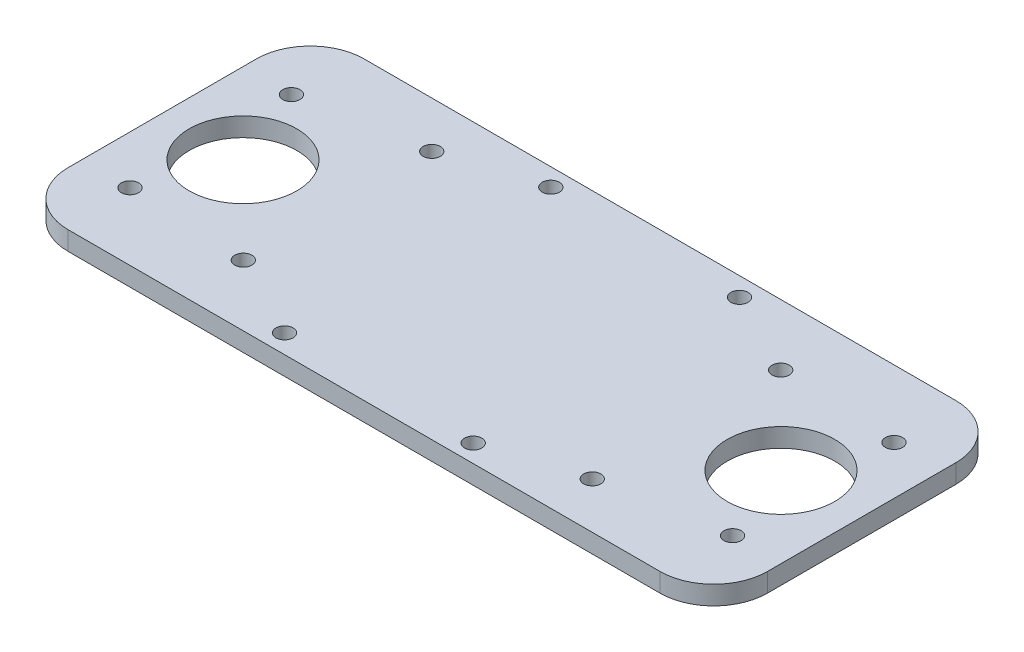
ISO-10303-21;
HEADER;
FILE_DESCRIPTION(('STEP AP214'),'2;1');
FILE_NAME('part.step','',(''),(''),'','','');
FILE_SCHEMA(('AUTOMOTIVE_DESIGN { 1 0 10303 214 1 1 1 1 }'));
ENDSEC;
DATA;
#1=APPLICATION_CONTEXT('core data for automotive mechanical design processes');
#2=APPLICATION_PROTOCOL_DEFINITION('international standard','automotive_design',2000,#1);
#3=PRODUCT_CONTEXT('',#1,'mechanical');
#4=PRODUCT('Part','Part','',(#3));
#5=PRODUCT_RELATED_PRODUCT_CATEGORY('part','',(#4));
#6=PRODUCT_DEFINITION_FORMATION('','',#4);
#7=PRODUCT_DEFINITION_CONTEXT('part definition',#1,'design');
#8=PRODUCT_DEFINITION('design','',#6,#7);
#9=PRODUCT_DEFINITION_SHAPE('','',#8);
#10=(LENGTH_UNIT() NAMED_UNIT(*) SI_UNIT(.MILLI.,.METRE.));
#11=(NAMED_UNIT(*) PLANE_ANGLE_UNIT() SI_UNIT($,.RADIAN.));
#12=(NAMED_UNIT(*) SI_UNIT($,.STERADIAN.) SOLID_ANGLE_UNIT());
#13=UNCERTAINTY_MEASURE_WITH_UNIT(LENGTH_MEASURE(1.E-05),#10,'distance_accuracy_value','');
#14=(GEOMETRIC_REPRESENTATION_CONTEXT(3) GLOBAL_UNCERTAINTY_ASSIGNED_CONTEXT((#13)) GLOBAL_UNIT_ASSIGNED_CONTEXT((#10,
#11,#12)) REPRESENTATION_CONTEXT('',''));
#15=CARTESIAN_POINT('',(0.,0.,0.));
#16=DIRECTION('',(0.,0.,1.));
#17=DIRECTION('',(1.,0.,0.));
#18=AXIS2_PLACEMENT_3D('',#15,#16,#17);
#19=CARTESIAN_POINT('',(0.,3.5,0.));
#20=DIRECTION('',(0.,1.,0.));
#21=DIRECTION('',(0.,0.,1.));
#22=AXIS2_PLACEMENT_3D('',#19,#20,#21);
#23=PLANE('',#22);
#24=CARTESIAN_POINT('',(31.1831474859931,3.5,8.59999999999931));
#25=DIRECTION('',(0.,1.,0.));
#26=DIRECTION('',(0.,0.,1.));
#27=AXIS2_PLACEMENT_3D('',#24,#25,#26);
#28=CIRCLE('',#27,1.6);
#29=CARTESIAN_POINT('',(31.1831474859931,3.5,10.1999999999993));
#30=VERTEX_POINT('',#29);
#31=EDGE_CURVE('E287',#30,#30,#28,.T.);
#32=ORIENTED_EDGE('',*,*,#31,.F.);
#33=EDGE_LOOP('',(#32));
#34=FACE_BOUND('',#33,.T.);
#35=CARTESIAN_POINT('',(15.,3.5,27.5));
#36=DIRECTION('',(0.,1.,0.));
#37=DIRECTION('',(0.,0.,1.));
#38=AXIS2_PLACEMENT_3D('',#35,#36,#37);
#39=CIRCLE('',#38,10.);
#40=CARTESIAN_POINT('',(15.,3.5,37.5));
#41=VERTEX_POINT('',#40);
#42=EDGE_CURVE('E271',#41,#41,#39,.T.);
#43=ORIENTED_EDGE('',*,*,#42,.F.);
#44=EDGE_LOOP('',(#43));
#45=FACE_BOUND('',#44,.T.);
#46=CARTESIAN_POINT('',(81.9831474859928,3.5,51.6999999999997));
#47=DIRECTION('',(0.,1.,0.));
#48=DIRECTION('',(0.,0.,1.));
#49=AXIS2_PLACEMENT_3D('',#46,#47,#48);
#50=CIRCLE('',#49,1.6);
#51=CARTESIAN_POINT('',(81.9831474859928,3.5,53.2999999999997));
#52=VERTEX_POINT('',#51);
#53=EDGE_CURVE('E255',#52,#52,#50,.T.);
#54=ORIENTED_EDGE('',*,*,#53,.F.);
#55=EDGE_LOOP('',(#54));
#56=FACE_BOUND('',#55,.T.);
#57=CARTESIAN_POINT('',(98.8168525140077,3.5,11.3789357077692));
#58=DIRECTION('',(0.,1.,0.));
#59=DIRECTION('',(0.,0.,1.));
#60=AXIS2_PLACEMENT_3D('',#57,#58,#59);
#61=CIRCLE('',#60,1.6);
#62=CARTESIAN_POINT('',(98.8168525140077,3.5,12.9789357077692));
#63=VERTEX_POINT('',#62);
#64=EDGE_CURVE('E239',#63,#63,#61,.T.);
#65=ORIENTED_EDGE('',*,*,#64,.F.);
#66=EDGE_LOOP('',(#65));
#67=FACE_BOUND('',#66,.T.);
#68=CARTESIAN_POINT('',(121.,3.5,42.5));
#69=DIRECTION('',(0.,1.,0.));
#70=DIRECTION('',(0.,0.,-1.));
#71=AXIS2_PLACEMENT_3D('',#68,#69,#70);
#72=CIRCLE('',#71,1.59999999999999);
#73=CARTESIAN_POINT('',(121.,3.5,40.9));
#74=VERTEX_POINT('',#73);
#75=EDGE_CURVE('E223',#74,#74,#72,.T.);
#76=ORIENTED_EDGE('',*,*,#75,.F.);
#77=EDGE_LOOP('',(#76));
#78=FACE_BOUND('',#77,.T.);
#79=CARTESIAN_POINT('',(48.0168525140077,3.5,3.3));
#80=DIRECTION('',(0.,1.,0.));
#81=DIRECTION('',(0.,0.,1.));
#82=AXIS2_PLACEMENT_3D('',#79,#80,#81);
#83=CIRCLE('',#82,1.6);
#84=CARTESIAN_POINT('',(48.0168525140077,3.5,4.9));
#85=VERTEX_POINT('',#84);
#86=EDGE_CURVE('E207',#85,#85,#83,.T.);
#87=ORIENTED_EDGE('',*,*,#86,.F.);
#88=EDGE_LOOP('',(#87));
#89=FACE_BOUND('',#88,.T.);
#90=CARTESIAN_POINT('',(9.,3.5,12.5));
#91=DIRECTION('',(0.,1.,0.));
#92=DIRECTION('',(0.,0.,1.));
#93=AXIS2_PLACEMENT_3D('',#90,#91,#92);
#94=CIRCLE('',#93,1.6);
#95=CARTESIAN_POINT('',(9.,3.5,14.1));
#96=VERTEX_POINT('',#95);
#97=EDGE_CURVE('E137',#96,#96,#94,.T.);
#98=ORIENTED_EDGE('',*,*,#97,.F.);
#99=EDGE_LOOP('',(#98));
#100=FACE_BOUND('',#99,.T.);
#101=DIRECTION('',(-1.,0.,0.));
#102=VECTOR('',#101,1.);
#103=CARTESIAN_POINT('',(0.,3.5,0.));
#104=LINE('',#103,#102);
#105=CARTESIAN_POINT('',(120.,3.5,0.));
#106=VERTEX_POINT('',#105);
#107=CARTESIAN_POINT('',(10.,3.5,0.));
#108=VERTEX_POINT('',#107);
#109=EDGE_CURVE('E148',#106,#108,#104,.T.);
#110=ORIENTED_EDGE('',*,*,#109,.T.);
#111=CARTESIAN_POINT('',(10.,3.5,10.));
#112=DIRECTION('',(0.,1.,0.));
#113=DIRECTION('',(0.,0.,1.));
#114=AXIS2_PLACEMENT_3D('',#111,#112,#113);
#115=CIRCLE('',#114,10.);
#116=CARTESIAN_POINT('',(0.,3.5,10.));
#117=VERTEX_POINT('',#116);
#118=EDGE_CURVE('E178',#108,#117,#115,.T.);
#119=ORIENTED_EDGE('',*,*,#118,.T.);
#120=DIRECTION('',(0.,0.,1.));
#121=VECTOR('',#120,1.);
#122=CARTESIAN_POINT('',(0.,3.5,0.));
#123=LINE('',#122,#121);
#124=CARTESIAN_POINT('',(0.,3.5,45.));
#125=VERTEX_POINT('',#124);
#126=EDGE_CURVE('E127',#117,#125,#123,.T.);
#127=ORIENTED_EDGE('',*,*,#126,.T.);
#128=CARTESIAN_POINT('',(10.,3.5,45.));
#129=DIRECTION('',(0.,1.,0.));
#130=DIRECTION('',(0.,0.,1.));
#131=AXIS2_PLACEMENT_3D('',#128,#129,#130);
#132=CIRCLE('',#131,10.);
#133=CARTESIAN_POINT('',(10.,3.5,55.));
#134=VERTEX_POINT('',#133);
#135=EDGE_CURVE('E175',#125,#134,#132,.T.);
#136=ORIENTED_EDGE('',*,*,#135,.T.);
#137=DIRECTION('',(1.,0.,0.));
#138=VECTOR('',#137,1.);
#139=CARTESIAN_POINT('',(0.,3.5,55.));
#140=LINE('',#139,#138);
#141=CARTESIAN_POINT('',(120.,3.5,55.));
#142=VERTEX_POINT('',#141);
#143=EDGE_CURVE('E193',#134,#142,#140,.T.);
#144=ORIENTED_EDGE('',*,*,#143,.T.);
#145=CARTESIAN_POINT('',(120.,3.5,45.));
#146=DIRECTION('',(0.,1.,0.));
#147=DIRECTION('',(0.,0.,1.));
#148=AXIS2_PLACEMENT_3D('',#145,#146,#147);
#149=CIRCLE('',#148,10.);
#150=CARTESIAN_POINT('',(130.,3.5,45.));
#151=VERTEX_POINT('',#150);
#152=EDGE_CURVE('E61',#142,#151,#149,.T.);
#153=ORIENTED_EDGE('',*,*,#152,.T.);
#154=DIRECTION('',(0.,0.,-1.));
#155=VECTOR('',#154,1.);
#156=CARTESIAN_POINT('',(130.,3.5,0.));
#157=LINE('',#156,#155);
#158=CARTESIAN_POINT('',(130.,3.5,10.));
#159=VERTEX_POINT('',#158);
#160=EDGE_CURVE('E191',#151,#159,#157,.T.);
#161=ORIENTED_EDGE('',*,*,#160,.T.);
#162=CARTESIAN_POINT('',(120.,3.5,10.));
#163=DIRECTION('',(0.,1.,0.));
#164=DIRECTION('',(0.,0.,1.));
#165=AXIS2_PLACEMENT_3D('',#162,#163,#164);
#166=CIRCLE('',#165,10.);
#167=EDGE_CURVE('E170',#159,#106,#166,.T.);
#168=ORIENTED_EDGE('',*,*,#167,.T.);
#169=EDGE_LOOP('',(#110,#119,#127,#136,#144,#153,#161,#168));
#170=FACE_BOUND('',#169,.T.);
#171=CARTESIAN_POINT('',(9.00000000000007,3.5,42.5));
#172=DIRECTION('',(0.,1.,0.));
#173=DIRECTION('',(0.,0.,1.));
#174=AXIS2_PLACEMENT_3D('',#171,#172,#173);
#175=CIRCLE('',#174,1.59999999999993);
#176=CARTESIAN_POINT('',(9.00000000000007,3.5,44.0999999999999));
#177=VERTEX_POINT('',#176);
#178=EDGE_CURVE('E201',#177,#177,#175,.T.);
#179=ORIENTED_EDGE('',*,*,#178,.F.);
#180=EDGE_LOOP('',(#179));
#181=FACE_BOUND('',#180,.T.);
#182=CARTESIAN_POINT('',(46.7168525140077,3.5,51.5));
#183=DIRECTION('',(0.,1.,0.));
#184=DIRECTION('',(0.,0.,1.));
#185=AXIS2_PLACEMENT_3D('',#182,#183,#184);
#186=CIRCLE('',#185,1.6);
#187=CARTESIAN_POINT('',(46.7168525140077,3.5,53.1));
#188=VERTEX_POINT('',#187);
#189=EDGE_CURVE('E215',#188,#188,#186,.T.);
#190=ORIENTED_EDGE('',*,*,#189,.F.);
#191=EDGE_LOOP('',(#190));
#192=FACE_BOUND('',#191,.T.);
#193=CARTESIAN_POINT('',(98.8168525140077,3.5,46.4));
#194=DIRECTION('',(0.,1.,0.));
#195=DIRECTION('',(0.,0.,1.));
#196=AXIS2_PLACEMENT_3D('',#193,#194,#195);
#197=CIRCLE('',#196,1.60000000000001);
#198=CARTESIAN_POINT('',(98.8168525140077,3.5,48.));
#199=VERTEX_POINT('',#198);
#200=EDGE_CURVE('E231',#199,#199,#197,.T.);
#201=ORIENTED_EDGE('',*,*,#200,.F.);
#202=EDGE_LOOP('',(#201));
#203=FACE_BOUND('',#202,.T.);
#204=CARTESIAN_POINT('',(121.,3.5,12.5));
#205=DIRECTION('',(0.,1.,0.));
#206=DIRECTION('',(0.,0.,-1.));
#207=AXIS2_PLACEMENT_3D('',#204,#205,#206);
#208=CIRCLE('',#207,1.59999999999999);
#209=CARTESIAN_POINT('',(121.,3.5,10.9));
#210=VERTEX_POINT('',#209);
#211=EDGE_CURVE('E247',#210,#210,#208,.T.);
#212=ORIENTED_EDGE('',*,*,#211,.F.);
#213=EDGE_LOOP('',(#212));
#214=FACE_BOUND('',#213,.T.);
#215=CARTESIAN_POINT('',(83.2831474859932,3.5,3.49999999999966));
#216=DIRECTION('',(0.,1.,0.));
#217=DIRECTION('',(0.,0.,1.));
#218=AXIS2_PLACEMENT_3D('',#215,#216,#217);
#219=CIRCLE('',#218,1.6);
#220=CARTESIAN_POINT('',(83.2831474859932,3.5,5.09999999999966));
#221=VERTEX_POINT('',#220);
#222=EDGE_CURVE('E263',#221,#221,#219,.T.);
#223=ORIENTED_EDGE('',*,*,#222,.F.);
#224=EDGE_LOOP('',(#223));
#225=FACE_BOUND('',#224,.T.);
#226=CARTESIAN_POINT('',(115.,3.5,27.5));
#227=DIRECTION('',(0.,1.,0.));
#228=DIRECTION('',(0.,0.,1.));
#229=AXIS2_PLACEMENT_3D('',#226,#227,#228);
#230=CIRCLE('',#229,9.99999999999999);
#231=CARTESIAN_POINT('',(115.,3.5,37.5));
#232=VERTEX_POINT('',#231);
#233=EDGE_CURVE('E279',#232,#232,#230,.T.);
#234=ORIENTED_EDGE('',*,*,#233,.F.);
#235=EDGE_LOOP('',(#234));
#236=FACE_BOUND('',#235,.T.);
#237=CARTESIAN_POINT('',(31.1831474859929,3.5,43.6210642922301));
#238=DIRECTION('',(0.,1.,0.));
#239=DIRECTION('',(0.,0.,1.));
#240=AXIS2_PLACEMENT_3D('',#237,#238,#239);
#241=CIRCLE('',#240,1.60000000000002);
#242=CARTESIAN_POINT('',(31.1831474859929,3.5,45.2210642922301));
#243=VERTEX_POINT('',#242);
#244=EDGE_CURVE('E295',#243,#243,#241,.T.);
#245=ORIENTED_EDGE('',*,*,#244,.F.);
#246=EDGE_LOOP('',(#245));
#247=FACE_BOUND('',#246,.T.);
#248=ADVANCED_FACE('F39',(#34,#45,#56,#67,#78,#89,#100,#170,#181,#192,#203,#214,#225,#236,#247),
#23,.T.);
#249=CARTESIAN_POINT('',(0.,0.,0.));
#250=DIRECTION('',(0.,1.,0.));
#251=DIRECTION('',(0.,0.,1.));
#252=AXIS2_PLACEMENT_3D('',#249,#250,#251);
#253=PLANE('',#252);
#254=DIRECTION('',(0.,0.,1.));
#255=VECTOR('',#254,1.);
#256=CARTESIAN_POINT('',(0.,0.,0.));
#257=LINE('',#256,#255);
#258=CARTESIAN_POINT('',(0.,0.,10.));
#259=VERTEX_POINT('',#258);
#260=CARTESIAN_POINT('',(0.,0.,45.));
#261=VERTEX_POINT('',#260);
#262=EDGE_CURVE('E124',#259,#261,#257,.T.);
#263=ORIENTED_EDGE('',*,*,#262,.F.);
#264=CARTESIAN_POINT('',(10.,0.,10.));
#265=DIRECTION('',(0.,1.,0.));
#266=DIRECTION('',(0.,0.,1.));
#267=AXIS2_PLACEMENT_3D('',#264,#265,#266);
#268=CIRCLE('',#267,10.);
#269=CARTESIAN_POINT('',(10.,0.,0.));
#270=VERTEX_POINT('',#269);
#271=EDGE_CURVE('E106',#259,#270,#268,.F.);
#272=ORIENTED_EDGE('',*,*,#271,.T.);
#273=DIRECTION('',(-1.,0.,0.));
#274=VECTOR('',#273,1.);
#275=CARTESIAN_POINT('',(0.,0.,0.));
#276=LINE('',#275,#274);
#277=CARTESIAN_POINT('',(120.,0.,0.));
#278=VERTEX_POINT('',#277);
#279=EDGE_CURVE('E153',#278,#270,#276,.T.);
#280=ORIENTED_EDGE('',*,*,#279,.F.);
#281=CARTESIAN_POINT('',(120.,0.,10.));
#282=DIRECTION('',(0.,1.,0.));
#283=DIRECTION('',(0.,0.,1.));
#284=AXIS2_PLACEMENT_3D('',#281,#282,#283);
#285=CIRCLE('',#284,10.);
#286=CARTESIAN_POINT('',(130.,0.,10.));
#287=VERTEX_POINT('',#286);
#288=EDGE_CURVE('E129',#278,#287,#285,.F.);
#289=ORIENTED_EDGE('',*,*,#288,.T.);
#290=DIRECTION('',(0.,0.,-1.));
#291=VECTOR('',#290,1.);
#292=CARTESIAN_POINT('',(130.,0.,0.));
#293=LINE('',#292,#291);
#294=CARTESIAN_POINT('',(130.,0.,45.));
#295=VERTEX_POINT('',#294);
#296=EDGE_CURVE('E142',#295,#287,#293,.T.);
#297=ORIENTED_EDGE('',*,*,#296,.F.);
#298=CARTESIAN_POINT('',(120.,0.,45.));
#299=DIRECTION('',(0.,1.,0.));
#300=DIRECTION('',(0.,0.,1.));
#301=AXIS2_PLACEMENT_3D('',#298,#299,#300);
#302=CIRCLE('',#301,10.);
#303=CARTESIAN_POINT('',(120.,0.,55.));
#304=VERTEX_POINT('',#303);
#305=EDGE_CURVE('E160',#295,#304,#302,.F.);
#306=ORIENTED_EDGE('',*,*,#305,.T.);
#307=DIRECTION('',(1.,0.,0.));
#308=VECTOR('',#307,1.);
#309=CARTESIAN_POINT('',(0.,0.,55.));
#310=LINE('',#309,#308);
#311=CARTESIAN_POINT('',(10.,0.,55.));
#312=VERTEX_POINT('',#311);
#313=EDGE_CURVE('E136',#312,#304,#310,.T.);
#314=ORIENTED_EDGE('',*,*,#313,.F.);
#315=CARTESIAN_POINT('',(10.,0.,45.));
#316=DIRECTION('',(0.,1.,0.));
#317=DIRECTION('',(0.,0.,1.));
#318=AXIS2_PLACEMENT_3D('',#315,#316,#317);
#319=CIRCLE('',#318,10.);
#320=EDGE_CURVE('E118',#312,#261,#319,.F.);
#321=ORIENTED_EDGE('',*,*,#320,.T.);
#322=EDGE_LOOP('',(#263,#272,#280,#289,#297,#306,#314,#321));
#323=FACE_BOUND('',#322,.T.);
#324=CARTESIAN_POINT('',(9.,0.,12.5));
#325=DIRECTION('',(0.,1.,0.));
#326=DIRECTION('',(0.,0.,1.));
#327=AXIS2_PLACEMENT_3D('',#324,#325,#326);
#328=CIRCLE('',#327,1.6);
#329=CARTESIAN_POINT('',(9.,0.,14.1));
#330=VERTEX_POINT('',#329);
#331=EDGE_CURVE('E145',#330,#330,#328,.T.);
#332=ORIENTED_EDGE('',*,*,#331,.T.);
#333=EDGE_LOOP('',(#332));
#334=FACE_BOUND('',#333,.T.);
#335=CARTESIAN_POINT('',(9.00000000000007,0.,42.5));
#336=DIRECTION('',(0.,1.,0.));
#337=DIRECTION('',(0.,0.,1.));
#338=AXIS2_PLACEMENT_3D('',#335,#336,#337);
#339=CIRCLE('',#338,1.59999999999993);
#340=CARTESIAN_POINT('',(9.00000000000007,0.,44.0999999999999));
#341=VERTEX_POINT('',#340);
#342=EDGE_CURVE('E203',#341,#341,#339,.T.);
#343=ORIENTED_EDGE('',*,*,#342,.T.);
#344=EDGE_LOOP('',(#343));
#345=FACE_BOUND('',#344,.T.);
#346=CARTESIAN_POINT('',(48.0168525140077,0.,3.3));
#347=DIRECTION('',(0.,1.,0.));
#348=DIRECTION('',(0.,0.,1.));
#349=AXIS2_PLACEMENT_3D('',#346,#347,#348);
#350=CIRCLE('',#349,1.6);
#351=CARTESIAN_POINT('',(48.0168525140077,0.,4.9));
#352=VERTEX_POINT('',#351);
#353=EDGE_CURVE('E211',#352,#352,#350,.T.);
#354=ORIENTED_EDGE('',*,*,#353,.T.);
#355=EDGE_LOOP('',(#354));
#356=FACE_BOUND('',#355,.T.);
#357=CARTESIAN_POINT('',(46.7168525140077,0.,51.5));
#358=DIRECTION('',(0.,1.,0.));
#359=DIRECTION('',(0.,0.,1.));
#360=AXIS2_PLACEMENT_3D('',#357,#358,#359);
#361=CIRCLE('',#360,1.6);
#362=CARTESIAN_POINT('',(46.7168525140077,0.,53.1));
#363=VERTEX_POINT('',#362);
#364=EDGE_CURVE('E219',#363,#363,#361,.T.);
#365=ORIENTED_EDGE('',*,*,#364,.T.);
#366=EDGE_LOOP('',(#365));
#367=FACE_BOUND('',#366,.T.);
#368=CARTESIAN_POINT('',(121.,0.,42.5));
#369=DIRECTION('',(0.,1.,0.));
#370=DIRECTION('',(0.,0.,-1.));
#371=AXIS2_PLACEMENT_3D('',#368,#369,#370);
#372=CIRCLE('',#371,1.59999999999999);
#373=CARTESIAN_POINT('',(121.,0.,40.9));
#374=VERTEX_POINT('',#373);
#375=EDGE_CURVE('E227',#374,#374,#372,.T.);
#376=ORIENTED_EDGE('',*,*,#375,.T.);
#377=EDGE_LOOP('',(#376));
#378=FACE_BOUND('',#377,.T.);
#379=CARTESIAN_POINT('',(98.8168525140077,0.,46.4));
#380=DIRECTION('',(0.,1.,0.));
#381=DIRECTION('',(0.,0.,1.));
#382=AXIS2_PLACEMENT_3D('',#379,#380,#381);
#383=CIRCLE('',#382,1.60000000000001);
#384=CARTESIAN_POINT('',(98.8168525140077,0.,48.));
#385=VERTEX_POINT('',#384);
#386=EDGE_CURVE('E235',#385,#385,#383,.T.);
#387=ORIENTED_EDGE('',*,*,#386,.T.);
#388=EDGE_LOOP('',(#387));
#389=FACE_BOUND('',#388,.T.);
#390=CARTESIAN_POINT('',(98.8168525140077,0.,11.3789357077692));
#391=DIRECTION('',(0.,1.,0.));
#392=DIRECTION('',(0.,0.,1.));
#393=AXIS2_PLACEMENT_3D('',#390,#391,#392);
#394=CIRCLE('',#393,1.6);
#395=CARTESIAN_POINT('',(98.8168525140077,0.,12.9789357077692));
#396=VERTEX_POINT('',#395);
#397=EDGE_CURVE('E243',#396,#396,#394,.T.);
#398=ORIENTED_EDGE('',*,*,#397,.T.);
#399=EDGE_LOOP('',(#398));
#400=FACE_BOUND('',#399,.T.);
#401=CARTESIAN_POINT('',(121.,0.,12.5));
#402=DIRECTION('',(0.,1.,0.));
#403=DIRECTION('',(0.,0.,-1.));
#404=AXIS2_PLACEMENT_3D('',#401,#402,#403);
#405=CIRCLE('',#404,1.59999999999999);
#406=CARTESIAN_POINT('',(121.,0.,10.9));
#407=VERTEX_POINT('',#406);
#408=EDGE_CURVE('E251',#407,#407,#405,.T.);
#409=ORIENTED_EDGE('',*,*,#408,.T.);
#410=EDGE_LOOP('',(#409));
#411=FACE_BOUND('',#410,.T.);
#412=CARTESIAN_POINT('',(81.9831474859928,0.,51.6999999999997));
#413=DIRECTION('',(0.,1.,0.));
#414=DIRECTION('',(0.,0.,1.));
#415=AXIS2_PLACEMENT_3D('',#412,#413,#414);
#416=CIRCLE('',#415,1.6);
#417=CARTESIAN_POINT('',(81.9831474859928,0.,53.2999999999997));
#418=VERTEX_POINT('',#417);
#419=EDGE_CURVE('E259',#418,#418,#416,.T.);
#420=ORIENTED_EDGE('',*,*,#419,.T.);
#421=EDGE_LOOP('',(#420));
#422=FACE_BOUND('',#421,.T.);
#423=CARTESIAN_POINT('',(83.2831474859932,0.,3.49999999999966));
#424=DIRECTION('',(0.,1.,0.));
#425=DIRECTION('',(0.,0.,1.));
#426=AXIS2_PLACEMENT_3D('',#423,#424,#425);
#427=CIRCLE('',#426,1.6);
#428=CARTESIAN_POINT('',(83.2831474859932,0.,5.09999999999966));
#429=VERTEX_POINT('',#428);
#430=EDGE_CURVE('E267',#429,#429,#427,.T.);
#431=ORIENTED_EDGE('',*,*,#430,.T.);
#432=EDGE_LOOP('',(#431));
#433=FACE_BOUND('',#432,.T.);
#434=CARTESIAN_POINT('',(15.,0.,27.5));
#435=DIRECTION('',(0.,1.,0.));
#436=DIRECTION('',(0.,0.,1.));
#437=AXIS2_PLACEMENT_3D('',#434,#435,#436);
#438=CIRCLE('',#437,10.);
#439=CARTESIAN_POINT('',(15.,0.,37.5));
#440=VERTEX_POINT('',#439);
#441=EDGE_CURVE('E275',#440,#440,#438,.T.);
#442=ORIENTED_EDGE('',*,*,#441,.T.);
#443=EDGE_LOOP('',(#442));
#444=FACE_BOUND('',#443,.T.);
#445=CARTESIAN_POINT('',(115.,0.,27.5));
#446=DIRECTION('',(0.,1.,0.));
#447=DIRECTION('',(0.,0.,1.));
#448=AXIS2_PLACEMENT_3D('',#445,#446,#447);
#449=CIRCLE('',#448,9.99999999999999);
#450=CARTESIAN_POINT('',(115.,0.,37.5));
#451=VERTEX_POINT('',#450);
#452=EDGE_CURVE('E283',#451,#451,#449,.T.);
#453=ORIENTED_EDGE('',*,*,#452,.T.);
#454=EDGE_LOOP('',(#453));
#455=FACE_BOUND('',#454,.T.);
#456=CARTESIAN_POINT('',(31.1831474859931,0.,8.59999999999931));
#457=DIRECTION('',(0.,1.,0.));
#458=DIRECTION('',(0.,0.,1.));
#459=AXIS2_PLACEMENT_3D('',#456,#457,#458);
#460=CIRCLE('',#459,1.6);
#461=CARTESIAN_POINT('',(31.1831474859931,0.,10.1999999999993));
#462=VERTEX_POINT('',#461);
#463=EDGE_CURVE('E291',#462,#462,#460,.T.);
#464=ORIENTED_EDGE('',*,*,#463,.T.);
#465=EDGE_LOOP('',(#464));
#466=FACE_BOUND('',#465,.T.);
#467=CARTESIAN_POINT('',(31.1831474859929,0.,43.6210642922301));
#468=DIRECTION('',(0.,1.,0.));
#469=DIRECTION('',(0.,0.,1.));
#470=AXIS2_PLACEMENT_3D('',#467,#468,#469);
#471=CIRCLE('',#470,1.60000000000002);
#472=CARTESIAN_POINT('',(31.1831474859929,0.,45.2210642922301));
#473=VERTEX_POINT('',#472);
#474=EDGE_CURVE('E299',#473,#473,#471,.T.);
#475=ORIENTED_EDGE('',*,*,#474,.T.);
#476=EDGE_LOOP('',(#475));
#477=FACE_BOUND('',#476,.T.);
#478=ADVANCED_FACE('F132',(#323,#334,#345,#356,#367,#378,#389,#400,#411,#422,#433,#444,#455,
#466,#477),#253,.F.);
#479=CARTESIAN_POINT('',(0.,3.5,0.));
#480=DIRECTION('',(1.,0.,0.));
#481=DIRECTION('',(0.,0.,-1.));
#482=AXIS2_PLACEMENT_3D('',#479,#480,#481);
#483=PLANE('',#482);
#484=ORIENTED_EDGE('',*,*,#126,.F.);
#485=DIRECTION('',(0.,-1.,0.));
#486=VECTOR('',#485,1.);
#487=CARTESIAN_POINT('',(0.,3.5,10.));
#488=LINE('',#487,#486);
#489=EDGE_CURVE('E110',#117,#259,#488,.T.);
#490=ORIENTED_EDGE('',*,*,#489,.T.);
#491=ORIENTED_EDGE('',*,*,#262,.T.);
#492=DIRECTION('',(0.,-1.,0.));
#493=VECTOR('',#492,1.);
#494=CARTESIAN_POINT('',(0.,3.5,45.));
#495=LINE('',#494,#493);
#496=EDGE_CURVE('E130',#261,#125,#495,.F.);
#497=ORIENTED_EDGE('',*,*,#496,.T.);
#498=EDGE_LOOP('',(#484,#490,#491,#497));
#499=FACE_BOUND('',#498,.T.);
#500=ADVANCED_FACE('F123',(#499),#483,.F.);
#501=CARTESIAN_POINT('',(0.,3.5,55.));
#502=DIRECTION('',(0.,0.,-1.));
#503=DIRECTION('',(-1.,0.,0.));
#504=AXIS2_PLACEMENT_3D('',#501,#502,#503);
#505=PLANE('',#504);
#506=ORIENTED_EDGE('',*,*,#143,.F.);
#507=DIRECTION('',(0.,-1.,0.));
#508=VECTOR('',#507,1.);
#509=CARTESIAN_POINT('',(10.,3.5,55.));
#510=LINE('',#509,#508);
#511=EDGE_CURVE('E184',#134,#312,#510,.T.);
#512=ORIENTED_EDGE('',*,*,#511,.T.);
#513=ORIENTED_EDGE('',*,*,#313,.T.);
#514=DIRECTION('',(0.,-1.,0.));
#515=VECTOR('',#514,1.);
#516=CARTESIAN_POINT('',(120.,3.5,55.));
#517=LINE('',#516,#515);
#518=EDGE_CURVE('E181',#304,#142,#517,.F.);
#519=ORIENTED_EDGE('',*,*,#518,.T.);
#520=EDGE_LOOP('',(#506,#512,#513,#519));
#521=FACE_BOUND('',#520,.T.);
#522=ADVANCED_FACE('F330',(#521),#505,.F.);
#523=CARTESIAN_POINT('',(130.,3.5,0.));
#524=DIRECTION('',(-1.,0.,0.));
#525=DIRECTION('',(0.,0.,1.));
#526=AXIS2_PLACEMENT_3D('',#523,#524,#525);
#527=PLANE('',#526);
#528=ORIENTED_EDGE('',*,*,#160,.F.);
#529=DIRECTION('',(0.,-1.,0.));
#530=VECTOR('',#529,1.);
#531=CARTESIAN_POINT('',(130.,3.5,45.));
#532=LINE('',#531,#530);
#533=EDGE_CURVE('E11',#151,#295,#532,.T.);
#534=ORIENTED_EDGE('',*,*,#533,.T.);
#535=ORIENTED_EDGE('',*,*,#296,.T.);
#536=DIRECTION('',(0.,-1.,0.));
#537=VECTOR('',#536,1.);
#538=CARTESIAN_POINT('',(130.,3.5,10.));
#539=LINE('',#538,#537);
#540=EDGE_CURVE('E48',#287,#159,#539,.F.);
#541=ORIENTED_EDGE('',*,*,#540,.T.);
#542=EDGE_LOOP('',(#528,#534,#535,#541));
#543=FACE_BOUND('',#542,.T.);
#544=ADVANCED_FACE('F326',(#543),#527,.F.);
#545=CARTESIAN_POINT('',(0.,3.5,0.));
#546=DIRECTION('',(0.,0.,1.));
#547=DIRECTION('',(1.,0.,0.));
#548=AXIS2_PLACEMENT_3D('',#545,#546,#547);
#549=PLANE('',#548);
#550=ORIENTED_EDGE('',*,*,#279,.T.);
#551=DIRECTION('',(0.,-1.,0.));
#552=VECTOR('',#551,1.);
#553=CARTESIAN_POINT('',(10.,3.5,0.));
#554=LINE('',#553,#552);
#555=EDGE_CURVE('E111',#270,#108,#554,.F.);
#556=ORIENTED_EDGE('',*,*,#555,.T.);
#557=ORIENTED_EDGE('',*,*,#109,.F.);
#558=DIRECTION('',(0.,-1.,0.));
#559=VECTOR('',#558,1.);
#560=CARTESIAN_POINT('',(120.,3.5,0.));
#561=LINE('',#560,#559);
#562=EDGE_CURVE('E117',#106,#278,#561,.T.);
#563=ORIENTED_EDGE('',*,*,#562,.T.);
#564=EDGE_LOOP('',(#550,#556,#557,#563));
#565=FACE_BOUND('',#564,.T.);
#566=ADVANCED_FACE('F323',(#565),#549,.F.);
#567=CARTESIAN_POINT('',(9.,3.5,12.5));
#568=DIRECTION('',(0.,-1.,0.));
#569=DIRECTION('',(0.,0.,-1.));
#570=AXIS2_PLACEMENT_3D('',#567,#568,#569);
#571=CYLINDRICAL_SURFACE('',#570,1.6);
#572=ORIENTED_EDGE('',*,*,#97,.T.);
#573=EDGE_LOOP('',(#572));
#574=FACE_BOUND('',#573,.T.);
#575=ORIENTED_EDGE('',*,*,#331,.F.);
#576=EDGE_LOOP('',(#575));
#577=FACE_BOUND('',#576,.T.);
#578=ADVANCED_FACE('F320',(#574,#577),#571,.F.);
#579=CARTESIAN_POINT('',(9.00000000000007,3.5,42.5));
#580=DIRECTION('',(0.,-1.,0.));
#581=DIRECTION('',(0.,0.,-1.));
#582=AXIS2_PLACEMENT_3D('',#579,#580,#581);
#583=CYLINDRICAL_SURFACE('',#582,1.59999999999993);
#584=ORIENTED_EDGE('',*,*,#178,.T.);
#585=EDGE_LOOP('',(#584));
#586=FACE_BOUND('',#585,.T.);
#587=ORIENTED_EDGE('',*,*,#342,.F.);
#588=EDGE_LOOP('',(#587));
#589=FACE_BOUND('',#588,.T.);
#590=ADVANCED_FACE('F420',(#586,#589),#583,.F.);
#591=CARTESIAN_POINT('',(48.0168525140077,3.5,3.3));
#592=DIRECTION('',(0.,-1.,0.));
#593=DIRECTION('',(0.,0.,-1.));
#594=AXIS2_PLACEMENT_3D('',#591,#592,#593);
#595=CYLINDRICAL_SURFACE('',#594,1.6);
#596=ORIENTED_EDGE('',*,*,#86,.T.);
#597=EDGE_LOOP('',(#596));
#598=FACE_BOUND('',#597,.T.);
#599=ORIENTED_EDGE('',*,*,#353,.F.);
#600=EDGE_LOOP('',(#599));
#601=FACE_BOUND('',#600,.T.);
#602=ADVANCED_FACE('F417',(#598,#601),#595,.F.);
#603=CARTESIAN_POINT('',(46.7168525140077,3.5,51.5));
#604=DIRECTION('',(0.,-1.,0.));
#605=DIRECTION('',(0.,0.,-1.));
#606=AXIS2_PLACEMENT_3D('',#603,#604,#605);
#607=CYLINDRICAL_SURFACE('',#606,1.6);
#608=ORIENTED_EDGE('',*,*,#189,.T.);
#609=EDGE_LOOP('',(#608));
#610=FACE_BOUND('',#609,.T.);
#611=ORIENTED_EDGE('',*,*,#364,.F.);
#612=EDGE_LOOP('',(#611));
#613=FACE_BOUND('',#612,.T.);
#614=ADVANCED_FACE('F413',(#610,#613),#607,.F.);
#615=CARTESIAN_POINT('',(121.,3.5,42.5));
#616=DIRECTION('',(0.,-1.,0.));
#617=DIRECTION('',(0.,0.,-1.));
#618=AXIS2_PLACEMENT_3D('',#615,#616,#617);
#619=CYLINDRICAL_SURFACE('',#618,1.59999999999999);
#620=ORIENTED_EDGE('',*,*,#75,.T.);
#621=EDGE_LOOP('',(#620));
#622=FACE_BOUND('',#621,.T.);
#623=ORIENTED_EDGE('',*,*,#375,.F.);
#624=EDGE_LOOP('',(#623));
#625=FACE_BOUND('',#624,.T.);
#626=ADVANCED_FACE('F409',(#622,#625),#619,.F.);
#627=CARTESIAN_POINT('',(98.8168525140077,3.5,46.4));
#628=DIRECTION('',(0.,-1.,0.));
#629=DIRECTION('',(0.,0.,-1.));
#630=AXIS2_PLACEMENT_3D('',#627,#628,#629);
#631=CYLINDRICAL_SURFACE('',#630,1.60000000000001);
#632=ORIENTED_EDGE('',*,*,#200,.T.);
#633=EDGE_LOOP('',(#632));
#634=FACE_BOUND('',#633,.T.);
#635=ORIENTED_EDGE('',*,*,#386,.F.);
#636=EDGE_LOOP('',(#635));
#637=FACE_BOUND('',#636,.T.);
#638=ADVANCED_FACE('F405',(#634,#637),#631,.F.);
#639=CARTESIAN_POINT('',(98.8168525140077,3.5,11.3789357077692));
#640=DIRECTION('',(0.,-1.,0.));
#641=DIRECTION('',(0.,0.,-1.));
#642=AXIS2_PLACEMENT_3D('',#639,#640,#641);
#643=CYLINDRICAL_SURFACE('',#642,1.6);
#644=ORIENTED_EDGE('',*,*,#64,.T.);
#645=EDGE_LOOP('',(#644));
#646=FACE_BOUND('',#645,.T.);
#647=ORIENTED_EDGE('',*,*,#397,.F.);
#648=EDGE_LOOP('',(#647));
#649=FACE_BOUND('',#648,.T.);
#650=ADVANCED_FACE('F401',(#646,#649),#643,.F.);
#651=CARTESIAN_POINT('',(121.,3.5,12.5));
#652=DIRECTION('',(0.,-1.,0.));
#653=DIRECTION('',(0.,0.,-1.));
#654=AXIS2_PLACEMENT_3D('',#651,#652,#653);
#655=CYLINDRICAL_SURFACE('',#654,1.59999999999999);
#656=ORIENTED_EDGE('',*,*,#211,.T.);
#657=EDGE_LOOP('',(#656));
#658=FACE_BOUND('',#657,.T.);
#659=ORIENTED_EDGE('',*,*,#408,.F.);
#660=EDGE_LOOP('',(#659));
#661=FACE_BOUND('',#660,.T.);
#662=ADVANCED_FACE('F397',(#658,#661),#655,.F.);
#663=CARTESIAN_POINT('',(81.9831474859928,3.5,51.6999999999997));
#664=DIRECTION('',(0.,-1.,0.));
#665=DIRECTION('',(0.,0.,-1.));
#666=AXIS2_PLACEMENT_3D('',#663,#664,#665);
#667=CYLINDRICAL_SURFACE('',#666,1.6);
#668=ORIENTED_EDGE('',*,*,#53,.T.);
#669=EDGE_LOOP('',(#668));
#670=FACE_BOUND('',#669,.T.);
#671=ORIENTED_EDGE('',*,*,#419,.F.);
#672=EDGE_LOOP('',(#671));
#673=FACE_BOUND('',#672,.T.);
#674=ADVANCED_FACE('F393',(#670,#673),#667,.F.);
#675=CARTESIAN_POINT('',(83.2831474859932,3.5,3.49999999999966));
#676=DIRECTION('',(0.,-1.,0.));
#677=DIRECTION('',(0.,0.,-1.));
#678=AXIS2_PLACEMENT_3D('',#675,#676,#677);
#679=CYLINDRICAL_SURFACE('',#678,1.6);
#680=ORIENTED_EDGE('',*,*,#222,.T.);
#681=EDGE_LOOP('',(#680));
#682=FACE_BOUND('',#681,.T.);
#683=ORIENTED_EDGE('',*,*,#430,.F.);
#684=EDGE_LOOP('',(#683));
#685=FACE_BOUND('',#684,.T.);
#686=ADVANCED_FACE('F389',(#682,#685),#679,.F.);
#687=CARTESIAN_POINT('',(15.,3.5,27.5));
#688=DIRECTION('',(0.,-1.,0.));
#689=DIRECTION('',(0.,0.,-1.));
#690=AXIS2_PLACEMENT_3D('',#687,#688,#689);
#691=CYLINDRICAL_SURFACE('',#690,10.);
#692=ORIENTED_EDGE('',*,*,#42,.T.);
#693=EDGE_LOOP('',(#692));
#694=FACE_BOUND('',#693,.T.);
#695=ORIENTED_EDGE('',*,*,#441,.F.);
#696=EDGE_LOOP('',(#695));
#697=FACE_BOUND('',#696,.T.);
#698=ADVANCED_FACE('F371',(#694,#697),#691,.F.);
#699=CARTESIAN_POINT('',(115.,3.5,27.5));
#700=DIRECTION('',(0.,-1.,0.));
#701=DIRECTION('',(0.,0.,-1.));
#702=AXIS2_PLACEMENT_3D('',#699,#700,#701);
#703=CYLINDRICAL_SURFACE('',#702,9.99999999999999);
#704=ORIENTED_EDGE('',*,*,#233,.T.);
#705=EDGE_LOOP('',(#704));
#706=FACE_BOUND('',#705,.T.);
#707=ORIENTED_EDGE('',*,*,#452,.F.);
#708=EDGE_LOOP('',(#707));
#709=FACE_BOUND('',#708,.T.);
#710=ADVANCED_FACE('F367',(#706,#709),#703,.F.);
#711=CARTESIAN_POINT('',(31.1831474859931,3.5,8.59999999999931));
#712=DIRECTION('',(0.,-1.,0.));
#713=DIRECTION('',(0.,0.,-1.));
#714=AXIS2_PLACEMENT_3D('',#711,#712,#713);
#715=CYLINDRICAL_SURFACE('',#714,1.6);
#716=ORIENTED_EDGE('',*,*,#31,.T.);
#717=EDGE_LOOP('',(#716));
#718=FACE_BOUND('',#717,.T.);
#719=ORIENTED_EDGE('',*,*,#463,.F.);
#720=EDGE_LOOP('',(#719));
#721=FACE_BOUND('',#720,.T.);
#722=ADVANCED_FACE('F370',(#718,#721),#715,.F.);
#723=CARTESIAN_POINT('',(31.1831474859929,3.5,43.6210642922301));
#724=DIRECTION('',(0.,-1.,0.));
#725=DIRECTION('',(0.,0.,-1.));
#726=AXIS2_PLACEMENT_3D('',#723,#724,#725);
#727=CYLINDRICAL_SURFACE('',#726,1.60000000000002);
#728=ORIENTED_EDGE('',*,*,#244,.T.);
#729=EDGE_LOOP('',(#728));
#730=FACE_BOUND('',#729,.T.);
#731=ORIENTED_EDGE('',*,*,#474,.F.);
#732=EDGE_LOOP('',(#731));
#733=FACE_BOUND('',#732,.T.);
#734=ADVANCED_FACE('F307',(#730,#733),#727,.F.);
#735=CARTESIAN_POINT('',(10.,3.5,10.));
#736=DIRECTION('',(0.,-1.,0.));
#737=DIRECTION('',(0.,0.,-1.));
#738=AXIS2_PLACEMENT_3D('',#735,#736,#737);
#739=CYLINDRICAL_SURFACE('',#738,10.);
#740=ORIENTED_EDGE('',*,*,#118,.F.);
#741=ORIENTED_EDGE('',*,*,#555,.F.);
#742=ORIENTED_EDGE('',*,*,#271,.F.);
#743=ORIENTED_EDGE('',*,*,#489,.F.);
#744=EDGE_LOOP('',(#740,#741,#742,#743));
#745=FACE_BOUND('',#744,.T.);
#746=ADVANCED_FACE('F109',(#745),#739,.T.);
#747=CARTESIAN_POINT('',(10.,3.5,45.));
#748=DIRECTION('',(0.,-1.,0.));
#749=DIRECTION('',(0.,0.,-1.));
#750=AXIS2_PLACEMENT_3D('',#747,#748,#749);
#751=CYLINDRICAL_SURFACE('',#750,10.);
#752=ORIENTED_EDGE('',*,*,#135,.F.);
#753=ORIENTED_EDGE('',*,*,#496,.F.);
#754=ORIENTED_EDGE('',*,*,#320,.F.);
#755=ORIENTED_EDGE('',*,*,#511,.F.);
#756=EDGE_LOOP('',(#752,#753,#754,#755));
#757=FACE_BOUND('',#756,.T.);
#758=ADVANCED_FACE('F338',(#757),#751,.T.);
#759=CARTESIAN_POINT('',(120.,3.5,45.));
#760=DIRECTION('',(0.,-1.,0.));
#761=DIRECTION('',(0.,0.,-1.));
#762=AXIS2_PLACEMENT_3D('',#759,#760,#761);
#763=CYLINDRICAL_SURFACE('',#762,10.);
#764=ORIENTED_EDGE('',*,*,#152,.F.);
#765=ORIENTED_EDGE('',*,*,#518,.F.);
#766=ORIENTED_EDGE('',*,*,#305,.F.);
#767=ORIENTED_EDGE('',*,*,#533,.F.);
#768=EDGE_LOOP('',(#764,#765,#766,#767));
#769=FACE_BOUND('',#768,.T.);
#770=ADVANCED_FACE('F340',(#769),#763,.T.);
#771=CARTESIAN_POINT('',(120.,3.5,10.));
#772=DIRECTION('',(0.,-1.,0.));
#773=DIRECTION('',(0.,0.,-1.));
#774=AXIS2_PLACEMENT_3D('',#771,#772,#773);
#775=CYLINDRICAL_SURFACE('',#774,10.);
#776=ORIENTED_EDGE('',*,*,#167,.F.);
#777=ORIENTED_EDGE('',*,*,#540,.F.);
#778=ORIENTED_EDGE('',*,*,#288,.F.);
#779=ORIENTED_EDGE('',*,*,#562,.F.);
#780=EDGE_LOOP('',(#776,#777,#778,#779));
#781=FACE_BOUND('',#780,.T.);
#782=ADVANCED_FACE('F41',(#781),#775,.T.);
#783=CLOSED_SHELL('',(#248,#478,#500,#522,#544,#566,#578,#590,#602,#614,#626,#638,#650,#662,
#674,#686,#698,#710,#722,#734,#746,#758,#770,#782));
#784=MANIFOLD_SOLID_BREP('B2',#783);
#785=ADVANCED_BREP_SHAPE_REPRESENTATION('',(#18,#784),#14);
#786=SHAPE_DEFINITION_REPRESENTATION(#9,#785);
ENDSEC;
END-ISO-10303-21;
